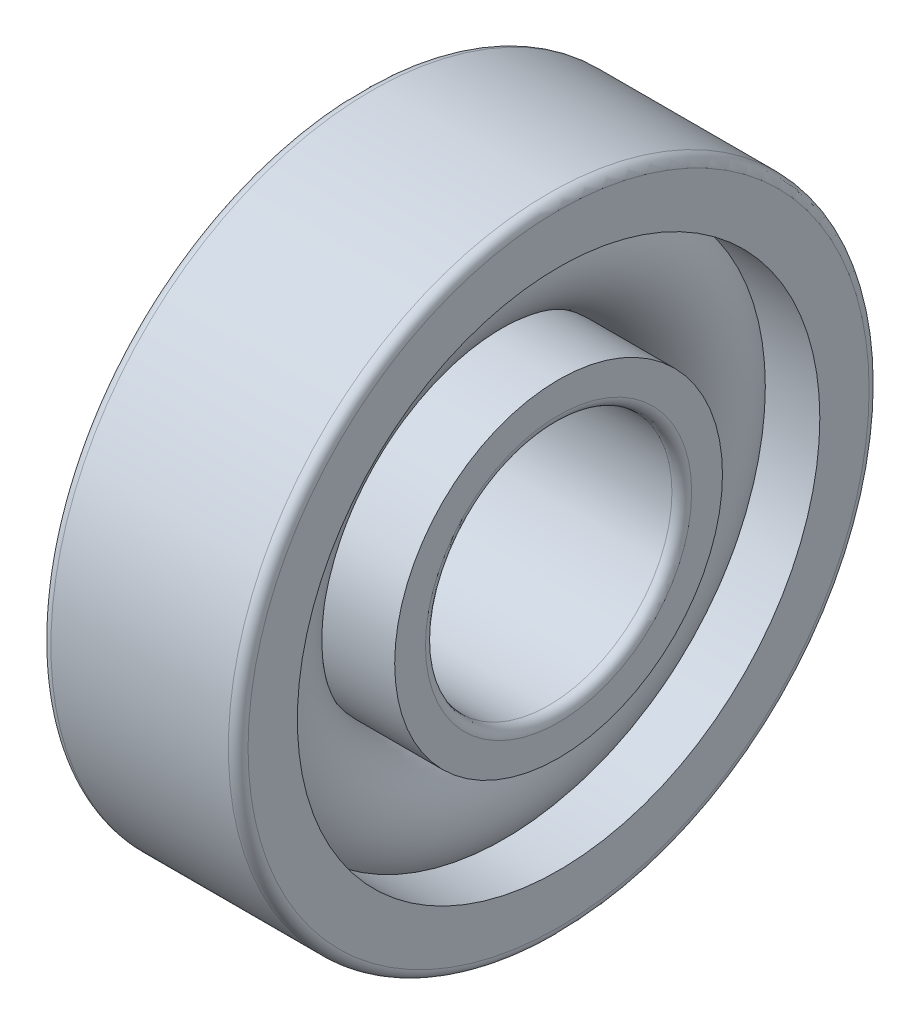
ISO-10303-21;
HEADER;
FILE_DESCRIPTION(('STEP AP214'),'2;1');
FILE_NAME('part.step','',(''),(''),'','','');
FILE_SCHEMA(('AUTOMOTIVE_DESIGN { 1 0 10303 214 1 1 1 1 }'));
ENDSEC;
DATA;
#1=APPLICATION_CONTEXT('core data for automotive mechanical design processes');
#2=APPLICATION_PROTOCOL_DEFINITION('international standard','automotive_design',2000,#1);
#3=PRODUCT_CONTEXT('',#1,'mechanical');
#4=PRODUCT('Part','Part','',(#3));
#5=PRODUCT_RELATED_PRODUCT_CATEGORY('part','',(#4));
#6=PRODUCT_DEFINITION_FORMATION('','',#4);
#7=PRODUCT_DEFINITION_CONTEXT('part definition',#1,'design');
#8=PRODUCT_DEFINITION('design','',#6,#7);
#9=PRODUCT_DEFINITION_SHAPE('','',#8);
#10=(LENGTH_UNIT() NAMED_UNIT(*) SI_UNIT(.MILLI.,.METRE.));
#11=(NAMED_UNIT(*) PLANE_ANGLE_UNIT() SI_UNIT($,.RADIAN.));
#12=(NAMED_UNIT(*) SI_UNIT($,.STERADIAN.) SOLID_ANGLE_UNIT());
#13=UNCERTAINTY_MEASURE_WITH_UNIT(LENGTH_MEASURE(1.E-05),#10,'distance_accuracy_value','');
#14=(GEOMETRIC_REPRESENTATION_CONTEXT(3) GLOBAL_UNCERTAINTY_ASSIGNED_CONTEXT((#13)) GLOBAL_UNIT_ASSIGNED_CONTEXT((#10,
#11,#12)) REPRESENTATION_CONTEXT('',''));
#15=CARTESIAN_POINT('',(0.,0.,0.));
#16=DIRECTION('',(0.,0.,1.));
#17=DIRECTION('',(1.,0.,0.));
#18=AXIS2_PLACEMENT_3D('',#15,#16,#17);
#19=CARTESIAN_POINT('',(0.,0.,0.));
#20=DIRECTION('',(-1.,0.,0.));
#21=DIRECTION('',(0.,0.,1.));
#22=AXIS2_PLACEMENT_3D('',#19,#20,#21);
#23=TOROIDAL_SURFACE('',#22,4.5,1.2);
#24=CARTESIAN_POINT('',(0.894427190999916,0.,0.));
#25=DIRECTION('',(-1.,0.,0.));
#26=DIRECTION('',(0.,0.,1.));
#27=AXIS2_PLACEMENT_3D('',#24,#25,#26);
#28=CIRCLE('',#27,5.3);
#29=CARTESIAN_POINT('',(0.894427190999916,0.,5.3));
#30=VERTEX_POINT('',#29);
#31=EDGE_CURVE('E34',#30,#30,#28,.F.);
#32=ORIENTED_EDGE('',*,*,#31,.T.);
#33=EDGE_LOOP('',(#32));
#34=FACE_BOUND('',#33,.T.);
#35=CARTESIAN_POINT('',(0.243669858620225,0.,0.));
#36=DIRECTION('',(-1.,0.,0.));
#37=DIRECTION('',(0.,0.,1.));
#38=AXIS2_PLACEMENT_3D('',#35,#36,#37);
#39=CIRCLE('',#38,3.325);
#40=CARTESIAN_POINT('',(0.243669858620225,0.,3.325));
#41=VERTEX_POINT('',#40);
#42=EDGE_CURVE('E10',#41,#41,#39,.T.);
#43=ORIENTED_EDGE('',*,*,#42,.T.);
#44=EDGE_LOOP('',(#43));
#45=FACE_BOUND('',#44,.T.);
#46=ADVANCED_FACE('F30',(#34,#45),#23,.T.);
#47=CARTESIAN_POINT('',(-20.6375,0.,0.));
#48=DIRECTION('',(1.,0.,0.));
#49=DIRECTION('',(0.,0.,-1.));
#50=AXIS2_PLACEMENT_3D('',#47,#48,#49);
#51=CYLINDRICAL_SURFACE('',#50,3.325);
#52=CARTESIAN_POINT('',(2.,0.,0.));
#53=DIRECTION('',(1.,0.,0.));
#54=DIRECTION('',(0.,0.,-1.));
#55=AXIS2_PLACEMENT_3D('',#52,#53,#54);
#56=CIRCLE('',#55,3.325);
#57=CARTESIAN_POINT('',(2.,0.,-3.325));
#58=VERTEX_POINT('',#57);
#59=EDGE_CURVE('E43',#58,#58,#56,.T.);
#60=ORIENTED_EDGE('',*,*,#59,.F.);
#61=EDGE_LOOP('',(#60));
#62=FACE_BOUND('',#61,.T.);
#63=ORIENTED_EDGE('',*,*,#42,.F.);
#64=EDGE_LOOP('',(#63));
#65=FACE_BOUND('',#64,.T.);
#66=ADVANCED_FACE('F82',(#62,#65),#51,.T.);
#67=CARTESIAN_POINT('',(-20.6375,0.,0.));
#68=DIRECTION('',(1.,0.,0.));
#69=DIRECTION('',(0.,0.,-1.));
#70=AXIS2_PLACEMENT_3D('',#67,#68,#69);
#71=CYLINDRICAL_SURFACE('',#70,3.7);
#72=CARTESIAN_POINT('',(-2.,0.,0.));
#73=DIRECTION('',(1.,0.,0.));
#74=DIRECTION('',(0.,0.,-1.));
#75=AXIS2_PLACEMENT_3D('',#72,#73,#74);
#76=CIRCLE('',#75,3.7);
#77=CARTESIAN_POINT('',(-2.,0.,-3.7));
#78=VERTEX_POINT('',#77);
#79=EDGE_CURVE('E52',#78,#78,#76,.T.);
#80=ORIENTED_EDGE('',*,*,#79,.T.);
#81=EDGE_LOOP('',(#80));
#82=FACE_BOUND('',#81,.T.);
#83=CARTESIAN_POINT('',(-0.894427190999917,0.,0.));
#84=DIRECTION('',(1.,0.,0.));
#85=DIRECTION('',(0.,0.,-1.));
#86=AXIS2_PLACEMENT_3D('',#83,#84,#85);
#87=CIRCLE('',#86,3.7);
#88=CARTESIAN_POINT('',(-0.894427190999917,0.,-3.7));
#89=VERTEX_POINT('',#88);
#90=EDGE_CURVE('E38',#89,#89,#87,.T.);
#91=ORIENTED_EDGE('',*,*,#90,.F.);
#92=EDGE_LOOP('',(#91));
#93=FACE_BOUND('',#92,.T.);
#94=ADVANCED_FACE('F85',(#82,#93),#71,.T.);
#95=CARTESIAN_POINT('',(2.,2.7,0.));
#96=DIRECTION('',(1.,0.,0.));
#97=DIRECTION('',(0.,0.,-1.));
#98=AXIS2_PLACEMENT_3D('',#95,#96,#97);
#99=PLANE('',#98);
#100=ORIENTED_EDGE('',*,*,#59,.T.);
#101=EDGE_LOOP('',(#100));
#102=FACE_BOUND('',#101,.T.);
#103=CARTESIAN_POINT('',(2.,0.,0.));
#104=DIRECTION('',(1.,0.,0.));
#105=DIRECTION('',(0.,0.,-1.));
#106=AXIS2_PLACEMENT_3D('',#103,#104,#105);
#107=CIRCLE('',#106,2.7);
#108=CARTESIAN_POINT('',(2.,0.,-2.7));
#109=VERTEX_POINT('',#108);
#110=EDGE_CURVE('E74',#109,#109,#107,.T.);
#111=ORIENTED_EDGE('',*,*,#110,.F.);
#112=EDGE_LOOP('',(#111));
#113=FACE_BOUND('',#112,.T.);
#114=ADVANCED_FACE('F79',(#102,#113),#99,.T.);
#115=CARTESIAN_POINT('',(1.8,0.,0.));
#116=DIRECTION('',(1.,0.,0.));
#117=DIRECTION('',(0.,0.,-1.));
#118=AXIS2_PLACEMENT_3D('',#115,#116,#117);
#119=TOROIDAL_SURFACE('',#118,2.7,0.200000000000001);
#120=ORIENTED_EDGE('',*,*,#110,.T.);
#121=EDGE_LOOP('',(#120));
#122=FACE_BOUND('',#121,.T.);
#123=CARTESIAN_POINT('',(1.8,0.,0.));
#124=DIRECTION('',(1.,0.,0.));
#125=DIRECTION('',(0.,0.,-1.));
#126=AXIS2_PLACEMENT_3D('',#123,#124,#125);
#127=CIRCLE('',#126,2.5);
#128=CARTESIAN_POINT('',(1.8,0.,-2.5));
#129=VERTEX_POINT('',#128);
#130=EDGE_CURVE('E71',#129,#129,#127,.T.);
#131=ORIENTED_EDGE('',*,*,#130,.F.);
#132=EDGE_LOOP('',(#131));
#133=FACE_BOUND('',#132,.T.);
#134=ADVANCED_FACE('F96',(#122,#133),#119,.T.);
#135=CARTESIAN_POINT('',(-20.6375,0.,0.));
#136=DIRECTION('',(1.,0.,0.));
#137=DIRECTION('',(0.,0.,-1.));
#138=AXIS2_PLACEMENT_3D('',#135,#136,#137);
#139=CYLINDRICAL_SURFACE('',#138,2.5);
#140=ORIENTED_EDGE('',*,*,#130,.T.);
#141=EDGE_LOOP('',(#140));
#142=FACE_BOUND('',#141,.T.);
#143=CARTESIAN_POINT('',(-1.8,0.,0.));
#144=DIRECTION('',(1.,0.,0.));
#145=DIRECTION('',(0.,0.,-1.));
#146=AXIS2_PLACEMENT_3D('',#143,#144,#145);
#147=CIRCLE('',#146,2.5);
#148=CARTESIAN_POINT('',(-1.8,0.,-2.5));
#149=VERTEX_POINT('',#148);
#150=EDGE_CURVE('E68',#149,#149,#147,.T.);
#151=ORIENTED_EDGE('',*,*,#150,.F.);
#152=EDGE_LOOP('',(#151));
#153=FACE_BOUND('',#152,.T.);
#154=ADVANCED_FACE('F99',(#142,#153),#139,.F.);
#155=CARTESIAN_POINT('',(-1.8,0.,0.));
#156=DIRECTION('',(1.,0.,0.));
#157=DIRECTION('',(0.,0.,-1.));
#158=AXIS2_PLACEMENT_3D('',#155,#156,#157);
#159=TOROIDAL_SURFACE('',#158,2.7,0.200000000000001);
#160=ORIENTED_EDGE('',*,*,#150,.T.);
#161=EDGE_LOOP('',(#160));
#162=FACE_BOUND('',#161,.T.);
#163=CARTESIAN_POINT('',(-2.,0.,0.));
#164=DIRECTION('',(1.,0.,0.));
#165=DIRECTION('',(0.,0.,-1.));
#166=AXIS2_PLACEMENT_3D('',#163,#164,#165);
#167=CIRCLE('',#166,2.7);
#168=CARTESIAN_POINT('',(-2.,0.,-2.7));
#169=VERTEX_POINT('',#168);
#170=EDGE_CURVE('E65',#169,#169,#167,.T.);
#171=ORIENTED_EDGE('',*,*,#170,.F.);
#172=EDGE_LOOP('',(#171));
#173=FACE_BOUND('',#172,.T.);
#174=ADVANCED_FACE('F103',(#162,#173),#159,.T.);
#175=CARTESIAN_POINT('',(-2.,3.7,0.));
#176=DIRECTION('',(-1.,0.,0.));
#177=DIRECTION('',(0.,0.,1.));
#178=AXIS2_PLACEMENT_3D('',#175,#176,#177);
#179=PLANE('',#178);
#180=ORIENTED_EDGE('',*,*,#170,.T.);
#181=EDGE_LOOP('',(#180));
#182=FACE_BOUND('',#181,.T.);
#183=ORIENTED_EDGE('',*,*,#79,.F.);
#184=EDGE_LOOP('',(#183));
#185=FACE_BOUND('',#184,.T.);
#186=ADVANCED_FACE('F107',(#182,#185),#179,.T.);
#187=CARTESIAN_POINT('',(-0.243669858620225,0.,0.));
#188=DIRECTION('',(1.,0.,0.));
#189=DIRECTION('',(0.,0.,-1.));
#190=AXIS2_PLACEMENT_3D('',#187,#188,#189);
#191=CIRCLE('',#190,5.675);
#192=CARTESIAN_POINT('',(-0.243669858620225,0.,-5.675));
#193=VERTEX_POINT('',#192);
#194=EDGE_CURVE('E46',#193,#193,#191,.F.);
#195=ORIENTED_EDGE('',*,*,#194,.T.);
#196=EDGE_LOOP('',(#195));
#197=FACE_BOUND('',#196,.T.);
#198=ORIENTED_EDGE('',*,*,#90,.T.);
#199=EDGE_LOOP('',(#198));
#200=FACE_BOUND('',#199,.T.);
#201=ADVANCED_FACE('F32',(#197,#200),#23,.T.);
#202=CARTESIAN_POINT('',(-20.6375,0.,0.));
#203=DIRECTION('',(1.,0.,0.));
#204=DIRECTION('',(0.,0.,-1.));
#205=AXIS2_PLACEMENT_3D('',#202,#203,#204);
#206=CYLINDRICAL_SURFACE('',#205,5.3);
#207=CARTESIAN_POINT('',(2.,0.,0.));
#208=DIRECTION('',(1.,0.,0.));
#209=DIRECTION('',(0.,0.,-1.));
#210=AXIS2_PLACEMENT_3D('',#207,#208,#209);
#211=CIRCLE('',#210,5.3);
#212=CARTESIAN_POINT('',(2.,0.,-5.3));
#213=VERTEX_POINT('',#212);
#214=EDGE_CURVE('E148',#213,#213,#211,.T.);
#215=ORIENTED_EDGE('',*,*,#214,.T.);
#216=EDGE_LOOP('',(#215));
#217=FACE_BOUND('',#216,.T.);
#218=ORIENTED_EDGE('',*,*,#31,.F.);
#219=EDGE_LOOP('',(#218));
#220=FACE_BOUND('',#219,.T.);
#221=ADVANCED_FACE('F129',(#217,#220),#206,.F.);
#222=CARTESIAN_POINT('',(-20.6375,0.,0.));
#223=DIRECTION('',(1.,0.,0.));
#224=DIRECTION('',(0.,0.,-1.));
#225=AXIS2_PLACEMENT_3D('',#222,#223,#224);
#226=CYLINDRICAL_SURFACE('',#225,5.675);
#227=CARTESIAN_POINT('',(-2.,0.,0.));
#228=DIRECTION('',(1.,0.,0.));
#229=DIRECTION('',(0.,0.,-1.));
#230=AXIS2_PLACEMENT_3D('',#227,#228,#229);
#231=CIRCLE('',#230,5.675);
#232=CARTESIAN_POINT('',(-2.,0.,-5.675));
#233=VERTEX_POINT('',#232);
#234=EDGE_CURVE('E143',#233,#233,#231,.T.);
#235=ORIENTED_EDGE('',*,*,#234,.F.);
#236=EDGE_LOOP('',(#235));
#237=FACE_BOUND('',#236,.T.);
#238=ORIENTED_EDGE('',*,*,#194,.F.);
#239=EDGE_LOOP('',(#238));
#240=FACE_BOUND('',#239,.T.);
#241=ADVANCED_FACE('F116',(#237,#240),#226,.F.);
#242=CARTESIAN_POINT('',(-1.8,0.,0.));
#243=DIRECTION('',(1.,0.,0.));
#244=DIRECTION('',(0.,0.,-1.));
#245=AXIS2_PLACEMENT_3D('',#242,#243,#244);
#246=TOROIDAL_SURFACE('',#245,6.3,0.200000000000001);
#247=CARTESIAN_POINT('',(-2.,0.,0.));
#248=DIRECTION('',(1.,0.,0.));
#249=DIRECTION('',(0.,0.,-1.));
#250=AXIS2_PLACEMENT_3D('',#247,#248,#249);
#251=CIRCLE('',#250,6.3);
#252=CARTESIAN_POINT('',(-2.,0.,-6.3));
#253=VERTEX_POINT('',#252);
#254=EDGE_CURVE('E146',#253,#253,#251,.T.);
#255=ORIENTED_EDGE('',*,*,#254,.T.);
#256=EDGE_LOOP('',(#255));
#257=FACE_BOUND('',#256,.T.);
#258=CARTESIAN_POINT('',(-1.8,0.,0.));
#259=DIRECTION('',(1.,0.,0.));
#260=DIRECTION('',(0.,0.,-1.));
#261=AXIS2_PLACEMENT_3D('',#258,#259,#260);
#262=CIRCLE('',#261,6.5);
#263=CARTESIAN_POINT('',(-1.8,0.,-6.5));
#264=VERTEX_POINT('',#263);
#265=EDGE_CURVE('E48',#264,#264,#262,.T.);
#266=ORIENTED_EDGE('',*,*,#265,.F.);
#267=EDGE_LOOP('',(#266));
#268=FACE_BOUND('',#267,.T.);
#269=ADVANCED_FACE('F112',(#257,#268),#246,.T.);
#270=CARTESIAN_POINT('',(-20.6375,0.,0.));
#271=DIRECTION('',(1.,0.,0.));
#272=DIRECTION('',(0.,0.,-1.));
#273=AXIS2_PLACEMENT_3D('',#270,#271,#272);
#274=CYLINDRICAL_SURFACE('',#273,6.5);
#275=ORIENTED_EDGE('',*,*,#265,.T.);
#276=EDGE_LOOP('',(#275));
#277=FACE_BOUND('',#276,.T.);
#278=CARTESIAN_POINT('',(1.8,0.,0.));
#279=DIRECTION('',(1.,0.,0.));
#280=DIRECTION('',(0.,0.,-1.));
#281=AXIS2_PLACEMENT_3D('',#278,#279,#280);
#282=CIRCLE('',#281,6.5);
#283=CARTESIAN_POINT('',(1.8,0.,-6.5));
#284=VERTEX_POINT('',#283);
#285=EDGE_CURVE('E54',#284,#284,#282,.T.);
#286=ORIENTED_EDGE('',*,*,#285,.F.);
#287=EDGE_LOOP('',(#286));
#288=FACE_BOUND('',#287,.T.);
#289=ADVANCED_FACE('F115',(#277,#288),#274,.T.);
#290=CARTESIAN_POINT('',(1.8,0.,0.));
#291=DIRECTION('',(1.,0.,0.));
#292=DIRECTION('',(0.,0.,-1.));
#293=AXIS2_PLACEMENT_3D('',#290,#291,#292);
#294=TOROIDAL_SURFACE('',#293,6.3,0.200000000000001);
#295=ORIENTED_EDGE('',*,*,#285,.T.);
#296=EDGE_LOOP('',(#295));
#297=FACE_BOUND('',#296,.T.);
#298=CARTESIAN_POINT('',(2.,0.,0.));
#299=DIRECTION('',(1.,0.,0.));
#300=DIRECTION('',(0.,0.,-1.));
#301=AXIS2_PLACEMENT_3D('',#298,#299,#300);
#302=CIRCLE('',#301,6.3);
#303=CARTESIAN_POINT('',(2.,0.,-6.3));
#304=VERTEX_POINT('',#303);
#305=EDGE_CURVE('E59',#304,#304,#302,.T.);
#306=ORIENTED_EDGE('',*,*,#305,.F.);
#307=EDGE_LOOP('',(#306));
#308=FACE_BOUND('',#307,.T.);
#309=ADVANCED_FACE('F120',(#297,#308),#294,.T.);
#310=CARTESIAN_POINT('',(2.,6.3,0.));
#311=DIRECTION('',(1.,0.,0.));
#312=DIRECTION('',(0.,0.,-1.));
#313=AXIS2_PLACEMENT_3D('',#310,#311,#312);
#314=PLANE('',#313);
#315=ORIENTED_EDGE('',*,*,#305,.T.);
#316=EDGE_LOOP('',(#315));
#317=FACE_BOUND('',#316,.T.);
#318=ORIENTED_EDGE('',*,*,#214,.F.);
#319=EDGE_LOOP('',(#318));
#320=FACE_BOUND('',#319,.T.);
#321=ADVANCED_FACE('F123',(#317,#320),#314,.T.);
#322=CARTESIAN_POINT('',(-2.,5.675,0.));
#323=DIRECTION('',(-1.,0.,0.));
#324=DIRECTION('',(0.,0.,1.));
#325=AXIS2_PLACEMENT_3D('',#322,#323,#324);
#326=PLANE('',#325);
#327=ORIENTED_EDGE('',*,*,#234,.T.);
#328=EDGE_LOOP('',(#327));
#329=FACE_BOUND('',#328,.T.);
#330=ORIENTED_EDGE('',*,*,#254,.F.);
#331=EDGE_LOOP('',(#330));
#332=FACE_BOUND('',#331,.T.);
#333=ADVANCED_FACE('F127',(#329,#332),#326,.T.);
#334=CLOSED_SHELL('',(#46,#66,#94,#114,#134,#154,#174,#186,#201,#221,#241,#269,#289,#309,#321,#333));
#335=MANIFOLD_SOLID_BREP('B2',#334);
#336=ADVANCED_BREP_SHAPE_REPRESENTATION('',(#18,#335),#14);
#337=SHAPE_DEFINITION_REPRESENTATION(#9,#336);
ENDSEC;
END-ISO-10303-21;
